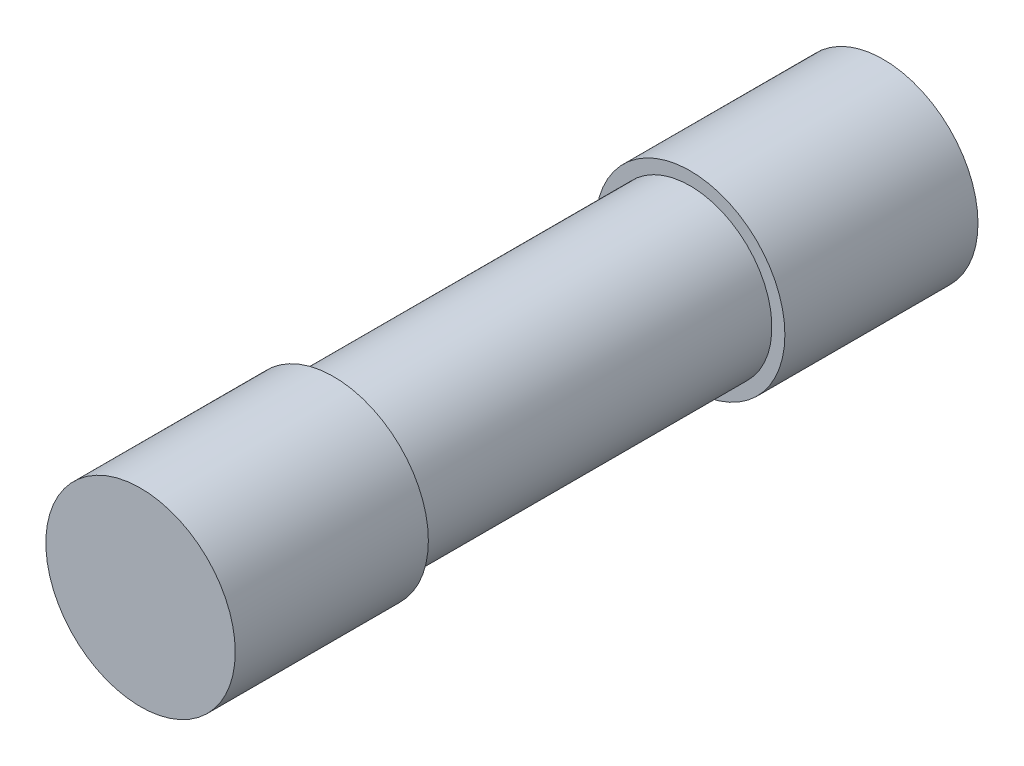
ISO-10303-21;
HEADER;
FILE_DESCRIPTION(('STEP AP214'),'2;1');
FILE_NAME('part.step','',(''),(''),'','','');
FILE_SCHEMA(('AUTOMOTIVE_DESIGN { 1 0 10303 214 1 1 1 1 }'));
ENDSEC;
DATA;
#1=APPLICATION_CONTEXT('core data for automotive mechanical design processes');
#2=APPLICATION_PROTOCOL_DEFINITION('international standard','automotive_design',2000,#1);
#3=PRODUCT_CONTEXT('',#1,'mechanical');
#4=PRODUCT('Part','Part','',(#3));
#5=PRODUCT_RELATED_PRODUCT_CATEGORY('part','',(#4));
#6=PRODUCT_DEFINITION_FORMATION('','',#4);
#7=PRODUCT_DEFINITION_CONTEXT('part definition',#1,'design');
#8=PRODUCT_DEFINITION('design','',#6,#7);
#9=PRODUCT_DEFINITION_SHAPE('','',#8);
#10=(LENGTH_UNIT() NAMED_UNIT(*) SI_UNIT(.MILLI.,.METRE.));
#11=(NAMED_UNIT(*) PLANE_ANGLE_UNIT() SI_UNIT($,.RADIAN.));
#12=(NAMED_UNIT(*) SI_UNIT($,.STERADIAN.) SOLID_ANGLE_UNIT());
#13=UNCERTAINTY_MEASURE_WITH_UNIT(LENGTH_MEASURE(1.E-05),#10,'distance_accuracy_value','');
#14=(GEOMETRIC_REPRESENTATION_CONTEXT(3) GLOBAL_UNCERTAINTY_ASSIGNED_CONTEXT((#13)) GLOBAL_UNIT_ASSIGNED_CONTEXT((#10,
#11,#12)) REPRESENTATION_CONTEXT('',''));
#15=CARTESIAN_POINT('',(0.,0.,0.));
#16=DIRECTION('',(0.,0.,1.));
#17=DIRECTION('',(1.,0.,0.));
#18=AXIS2_PLACEMENT_3D('',#15,#16,#17);
#19=CARTESIAN_POINT('',(0.,0.,-10.));
#20=DIRECTION('',(0.,0.,-1.));
#21=DIRECTION('',(-1.,0.,0.));
#22=AXIS2_PLACEMENT_3D('',#19,#20,#21);
#23=PLANE('',#22);
#24=CARTESIAN_POINT('',(0.,0.,-10.));
#25=DIRECTION('',(0.,0.,1.));
#26=DIRECTION('',(1.,0.,0.));
#27=AXIS2_PLACEMENT_3D('',#24,#25,#26);
#28=CIRCLE('',#27,2.55);
#29=CARTESIAN_POINT('',(2.55,0.,-10.));
#30=VERTEX_POINT('',#29);
#31=EDGE_CURVE('E18',#30,#30,#28,.T.);
#32=ORIENTED_EDGE('',*,*,#31,.F.);
#33=EDGE_LOOP('',(#32));
#34=FACE_BOUND('',#33,.T.);
#35=ADVANCED_FACE('F15',(#34),#23,.T.);
#36=CARTESIAN_POINT('',(0.,0.,10.));
#37=DIRECTION('',(0.,0.,-1.));
#38=DIRECTION('',(-1.,0.,0.));
#39=AXIS2_PLACEMENT_3D('',#36,#37,#38);
#40=PLANE('',#39);
#41=CARTESIAN_POINT('',(0.,0.,10.));
#42=DIRECTION('',(0.,0.,1.));
#43=DIRECTION('',(1.,0.,0.));
#44=AXIS2_PLACEMENT_3D('',#41,#42,#43);
#45=CIRCLE('',#44,2.55);
#46=CARTESIAN_POINT('',(2.55,0.,10.));
#47=VERTEX_POINT('',#46);
#48=EDGE_CURVE('E34',#47,#47,#45,.F.);
#49=ORIENTED_EDGE('',*,*,#48,.F.);
#50=EDGE_LOOP('',(#49));
#51=FACE_BOUND('',#50,.T.);
#52=ADVANCED_FACE('F44',(#51),#40,.F.);
#53=CARTESIAN_POINT('',(0.,0.,0.));
#54=DIRECTION('',(0.,0.,1.));
#55=DIRECTION('',(1.,0.,0.));
#56=AXIS2_PLACEMENT_3D('',#53,#54,#55);
#57=CYLINDRICAL_SURFACE('',#56,2.55);
#58=CARTESIAN_POINT('',(0.,0.,-4.8));
#59=DIRECTION('',(0.,0.,1.));
#60=DIRECTION('',(1.,0.,0.));
#61=AXIS2_PLACEMENT_3D('',#58,#59,#60);
#62=CIRCLE('',#61,2.55);
#63=CARTESIAN_POINT('',(2.55,0.,-4.8));
#64=VERTEX_POINT('',#63);
#65=EDGE_CURVE('E32',#64,#64,#62,.F.);
#66=ORIENTED_EDGE('',*,*,#65,.T.);
#67=EDGE_LOOP('',(#66));
#68=FACE_BOUND('',#67,.T.);
#69=ORIENTED_EDGE('',*,*,#31,.T.);
#70=EDGE_LOOP('',(#69));
#71=FACE_BOUND('',#70,.T.);
#72=ADVANCED_FACE('F41',(#68,#71),#57,.T.);
#73=CARTESIAN_POINT('',(0.,0.,0.));
#74=DIRECTION('',(0.,0.,1.));
#75=DIRECTION('',(1.,0.,0.));
#76=AXIS2_PLACEMENT_3D('',#73,#74,#75);
#77=CYLINDRICAL_SURFACE('',#76,2.55);
#78=ORIENTED_EDGE('',*,*,#48,.T.);
#79=EDGE_LOOP('',(#78));
#80=FACE_BOUND('',#79,.T.);
#81=CARTESIAN_POINT('',(0.,0.,4.8));
#82=DIRECTION('',(0.,0.,1.));
#83=DIRECTION('',(1.,0.,0.));
#84=AXIS2_PLACEMENT_3D('',#81,#82,#83);
#85=CIRCLE('',#84,2.55);
#86=CARTESIAN_POINT('',(2.55,0.,4.8));
#87=VERTEX_POINT('',#86);
#88=EDGE_CURVE('E27',#87,#87,#85,.F.);
#89=ORIENTED_EDGE('',*,*,#88,.F.);
#90=EDGE_LOOP('',(#89));
#91=FACE_BOUND('',#90,.T.);
#92=ADVANCED_FACE('F64',(#80,#91),#77,.T.);
#93=CARTESIAN_POINT('',(0.,0.,-4.8));
#94=DIRECTION('',(0.,0.,-1.));
#95=DIRECTION('',(-1.,0.,0.));
#96=AXIS2_PLACEMENT_3D('',#93,#94,#95);
#97=PLANE('',#96);
#98=CARTESIAN_POINT('',(0.,0.,-4.80000000075));
#99=DIRECTION('',(0.,0.,-1.));
#100=DIRECTION('',(-1.,0.,0.));
#101=AXIS2_PLACEMENT_3D('',#98,#99,#100);
#102=CIRCLE('',#101,2.2);
#103=CARTESIAN_POINT('',(-2.2,0.,-4.80000000075));
#104=VERTEX_POINT('',#103);
#105=EDGE_CURVE('E22',#104,#104,#102,.F.);
#106=ORIENTED_EDGE('',*,*,#105,.F.);
#107=EDGE_LOOP('',(#106));
#108=FACE_BOUND('',#107,.T.);
#109=ORIENTED_EDGE('',*,*,#65,.F.);
#110=EDGE_LOOP('',(#109));
#111=FACE_BOUND('',#110,.T.);
#112=ADVANCED_FACE('F58',(#108,#111),#97,.F.);
#113=CARTESIAN_POINT('',(0.,0.,4.8));
#114=DIRECTION('',(0.,0.,-1.));
#115=DIRECTION('',(-1.,0.,0.));
#116=AXIS2_PLACEMENT_3D('',#113,#114,#115);
#117=PLANE('',#116);
#118=CARTESIAN_POINT('',(0.,0.,4.80000000075));
#119=DIRECTION('',(0.,0.,-1.));
#120=DIRECTION('',(-1.,0.,0.));
#121=AXIS2_PLACEMENT_3D('',#118,#119,#120);
#122=CIRCLE('',#121,2.2);
#123=CARTESIAN_POINT('',(-2.2,0.,4.80000000075));
#124=VERTEX_POINT('',#123);
#125=EDGE_CURVE('E10',#124,#124,#122,.T.);
#126=ORIENTED_EDGE('',*,*,#125,.F.);
#127=EDGE_LOOP('',(#126));
#128=FACE_BOUND('',#127,.T.);
#129=ORIENTED_EDGE('',*,*,#88,.T.);
#130=EDGE_LOOP('',(#129));
#131=FACE_BOUND('',#130,.T.);
#132=ADVANCED_FACE('F52',(#128,#131),#117,.T.);
#133=CARTESIAN_POINT('',(0.,0.,0.));
#134=DIRECTION('',(0.,0.,-1.));
#135=DIRECTION('',(-1.,0.,0.));
#136=AXIS2_PLACEMENT_3D('',#133,#134,#135);
#137=CYLINDRICAL_SURFACE('',#136,2.2);
#138=ORIENTED_EDGE('',*,*,#105,.T.);
#139=EDGE_LOOP('',(#138));
#140=FACE_BOUND('',#139,.T.);
#141=ORIENTED_EDGE('',*,*,#125,.T.);
#142=EDGE_LOOP('',(#141));
#143=FACE_BOUND('',#142,.T.);
#144=ADVANCED_FACE('F50',(#140,#143),#137,.T.);
#145=CLOSED_SHELL('',(#35,#52,#72,#92,#112,#132,#144));
#146=MANIFOLD_SOLID_BREP('B1',#145);
#147=ADVANCED_BREP_SHAPE_REPRESENTATION('',(#18,#146),#14);
#148=SHAPE_DEFINITION_REPRESENTATION(#9,#147);
ENDSEC;
END-ISO-10303-21;
